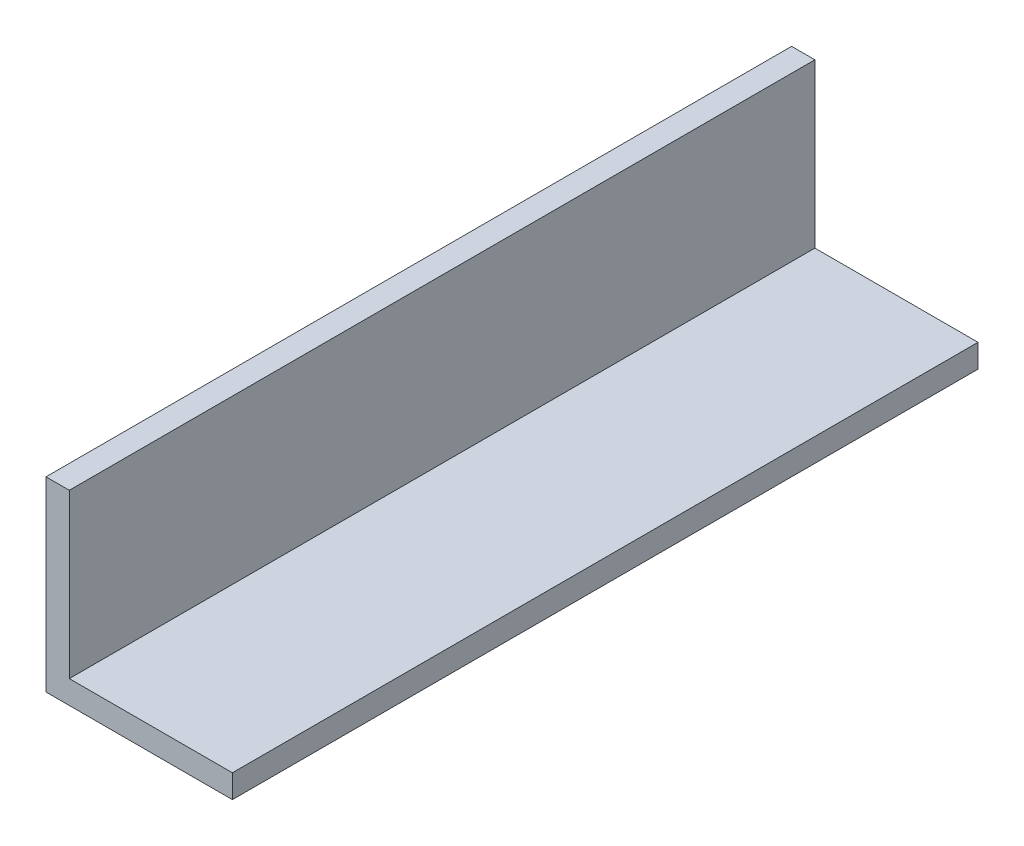
ISO-10303-21;
HEADER;
FILE_DESCRIPTION(('STEP AP214'),'2;1');
FILE_NAME('part.step','',(''),(''),'','','');
FILE_SCHEMA(('AUTOMOTIVE_DESIGN { 1 0 10303 214 1 1 1 1 }'));
ENDSEC;
DATA;
#1=APPLICATION_CONTEXT('core data for automotive mechanical design processes');
#2=APPLICATION_PROTOCOL_DEFINITION('international standard','automotive_design',2000,#1);
#3=PRODUCT_CONTEXT('',#1,'mechanical');
#4=PRODUCT('Part','Part','',(#3));
#5=PRODUCT_RELATED_PRODUCT_CATEGORY('part','',(#4));
#6=PRODUCT_DEFINITION_FORMATION('','',#4);
#7=PRODUCT_DEFINITION_CONTEXT('part definition',#1,'design');
#8=PRODUCT_DEFINITION('design','',#6,#7);
#9=PRODUCT_DEFINITION_SHAPE('','',#8);
#10=(LENGTH_UNIT() NAMED_UNIT(*) SI_UNIT(.MILLI.,.METRE.));
#11=(NAMED_UNIT(*) PLANE_ANGLE_UNIT() SI_UNIT($,.RADIAN.));
#12=(NAMED_UNIT(*) SI_UNIT($,.STERADIAN.) SOLID_ANGLE_UNIT());
#13=UNCERTAINTY_MEASURE_WITH_UNIT(LENGTH_MEASURE(1.E-05),#10,'distance_accuracy_value','');
#14=(GEOMETRIC_REPRESENTATION_CONTEXT(3) GLOBAL_UNCERTAINTY_ASSIGNED_CONTEXT((#13)) GLOBAL_UNIT_ASSIGNED_CONTEXT((#10,
#11,#12)) REPRESENTATION_CONTEXT('',''));
#15=CARTESIAN_POINT('',(0.,0.,0.));
#16=DIRECTION('',(0.,0.,1.));
#17=DIRECTION('',(1.,0.,0.));
#18=AXIS2_PLACEMENT_3D('',#15,#16,#17);
#19=CARTESIAN_POINT('',(3.175,25.4,50.8));
#20=DIRECTION('',(0.,-1.,0.));
#21=DIRECTION('',(0.,0.,-1.));
#22=AXIS2_PLACEMENT_3D('',#19,#20,#21);
#23=PLANE('',#22);
#24=DIRECTION('',(-1.,0.,0.));
#25=VECTOR('',#24,1.);
#26=CARTESIAN_POINT('',(3.175,25.4,-50.8));
#27=LINE('',#26,#25);
#28=CARTESIAN_POINT('',(3.175,25.4,-50.8));
#29=VERTEX_POINT('',#28);
#30=CARTESIAN_POINT('',(0.,25.4,-50.8));
#31=VERTEX_POINT('',#30);
#32=EDGE_CURVE('E127',#29,#31,#27,.T.);
#33=ORIENTED_EDGE('',*,*,#32,.T.);
#34=DIRECTION('',(0.,0.,-1.));
#35=VECTOR('',#34,1.);
#36=CARTESIAN_POINT('',(0.,25.4,50.8));
#37=LINE('',#36,#35);
#38=CARTESIAN_POINT('',(0.,25.4,50.8));
#39=VERTEX_POINT('',#38);
#40=EDGE_CURVE('E11',#39,#31,#37,.T.);
#41=ORIENTED_EDGE('',*,*,#40,.F.);
#42=DIRECTION('',(-1.,0.,0.));
#43=VECTOR('',#42,1.);
#44=CARTESIAN_POINT('',(3.175,25.4,50.8));
#45=LINE('',#44,#43);
#46=CARTESIAN_POINT('',(3.175,25.4,50.8));
#47=VERTEX_POINT('',#46);
#48=EDGE_CURVE('E137',#47,#39,#45,.T.);
#49=ORIENTED_EDGE('',*,*,#48,.F.);
#50=DIRECTION('',(0.,0.,-1.));
#51=VECTOR('',#50,1.);
#52=CARTESIAN_POINT('',(3.175,25.4,50.8));
#53=LINE('',#52,#51);
#54=EDGE_CURVE('E123',#47,#29,#53,.T.);
#55=ORIENTED_EDGE('',*,*,#54,.T.);
#56=EDGE_LOOP('',(#33,#41,#49,#55));
#57=FACE_BOUND('',#56,.T.);
#58=ADVANCED_FACE('F43',(#57),#23,.F.);
#59=CARTESIAN_POINT('',(0.,25.4,50.8));
#60=DIRECTION('',(1.,0.,0.));
#61=DIRECTION('',(0.,0.,-1.));
#62=AXIS2_PLACEMENT_3D('',#59,#60,#61);
#63=PLANE('',#62);
#64=DIRECTION('',(0.,-1.,0.));
#65=VECTOR('',#64,1.);
#66=CARTESIAN_POINT('',(0.,25.4,-50.8));
#67=LINE('',#66,#65);
#68=CARTESIAN_POINT('',(0.,0.,-50.8));
#69=VERTEX_POINT('',#68);
#70=EDGE_CURVE('E130',#31,#69,#67,.T.);
#71=ORIENTED_EDGE('',*,*,#70,.T.);
#72=DIRECTION('',(0.,0.,-1.));
#73=VECTOR('',#72,1.);
#74=CARTESIAN_POINT('',(0.,0.,50.8));
#75=LINE('',#74,#73);
#76=CARTESIAN_POINT('',(0.,0.,50.8));
#77=VERTEX_POINT('',#76);
#78=EDGE_CURVE('E51',#77,#69,#75,.T.);
#79=ORIENTED_EDGE('',*,*,#78,.F.);
#80=DIRECTION('',(0.,-1.,0.));
#81=VECTOR('',#80,1.);
#82=CARTESIAN_POINT('',(0.,25.4,50.8));
#83=LINE('',#82,#81);
#84=EDGE_CURVE('E96',#39,#77,#83,.T.);
#85=ORIENTED_EDGE('',*,*,#84,.F.);
#86=ORIENTED_EDGE('',*,*,#40,.T.);
#87=EDGE_LOOP('',(#71,#79,#85,#86));
#88=FACE_BOUND('',#87,.T.);
#89=ADVANCED_FACE('F161',(#88),#63,.F.);
#90=CARTESIAN_POINT('',(0.,0.,50.8));
#91=DIRECTION('',(0.,1.,0.));
#92=DIRECTION('',(0.,0.,1.));
#93=AXIS2_PLACEMENT_3D('',#90,#91,#92);
#94=PLANE('',#93);
#95=DIRECTION('',(1.,0.,0.));
#96=VECTOR('',#95,1.);
#97=CARTESIAN_POINT('',(0.,0.,-50.8));
#98=LINE('',#97,#96);
#99=CARTESIAN_POINT('',(25.4,0.,-50.8));
#100=VERTEX_POINT('',#99);
#101=EDGE_CURVE('E132',#69,#100,#98,.T.);
#102=ORIENTED_EDGE('',*,*,#101,.T.);
#103=DIRECTION('',(0.,0.,-1.));
#104=VECTOR('',#103,1.);
#105=CARTESIAN_POINT('',(25.4,0.,50.8));
#106=LINE('',#105,#104);
#107=CARTESIAN_POINT('',(25.4,0.,50.8));
#108=VERTEX_POINT('',#107);
#109=EDGE_CURVE('E118',#108,#100,#106,.T.);
#110=ORIENTED_EDGE('',*,*,#109,.F.);
#111=DIRECTION('',(1.,0.,0.));
#112=VECTOR('',#111,1.);
#113=CARTESIAN_POINT('',(0.,0.,50.8));
#114=LINE('',#113,#112);
#115=EDGE_CURVE('E109',#77,#108,#114,.T.);
#116=ORIENTED_EDGE('',*,*,#115,.F.);
#117=ORIENTED_EDGE('',*,*,#78,.T.);
#118=EDGE_LOOP('',(#102,#110,#116,#117));
#119=FACE_BOUND('',#118,.T.);
#120=ADVANCED_FACE('F143',(#119),#94,.F.);
#121=CARTESIAN_POINT('',(25.4,0.,50.8));
#122=DIRECTION('',(-1.,0.,0.));
#123=DIRECTION('',(0.,0.,1.));
#124=AXIS2_PLACEMENT_3D('',#121,#122,#123);
#125=PLANE('',#124);
#126=DIRECTION('',(0.,1.,0.));
#127=VECTOR('',#126,1.);
#128=CARTESIAN_POINT('',(25.4,0.,-50.8));
#129=LINE('',#128,#127);
#130=CARTESIAN_POINT('',(25.4,3.175,-50.8));
#131=VERTEX_POINT('',#130);
#132=EDGE_CURVE('E117',#100,#131,#129,.T.);
#133=ORIENTED_EDGE('',*,*,#132,.T.);
#134=DIRECTION('',(0.,0.,-1.));
#135=VECTOR('',#134,1.);
#136=CARTESIAN_POINT('',(25.4,3.175,50.8));
#137=LINE('',#136,#135);
#138=CARTESIAN_POINT('',(25.4,3.175,50.8));
#139=VERTEX_POINT('',#138);
#140=EDGE_CURVE('E114',#139,#131,#137,.T.);
#141=ORIENTED_EDGE('',*,*,#140,.F.);
#142=DIRECTION('',(0.,1.,0.));
#143=VECTOR('',#142,1.);
#144=CARTESIAN_POINT('',(25.4,0.,50.8));
#145=LINE('',#144,#143);
#146=EDGE_CURVE('E103',#108,#139,#145,.T.);
#147=ORIENTED_EDGE('',*,*,#146,.F.);
#148=ORIENTED_EDGE('',*,*,#109,.T.);
#149=EDGE_LOOP('',(#133,#141,#147,#148));
#150=FACE_BOUND('',#149,.T.);
#151=ADVANCED_FACE('F115',(#150),#125,.F.);
#152=CARTESIAN_POINT('',(25.4,3.175,50.8));
#153=DIRECTION('',(0.,-1.,0.));
#154=DIRECTION('',(0.,0.,-1.));
#155=AXIS2_PLACEMENT_3D('',#152,#153,#154);
#156=PLANE('',#155);
#157=DIRECTION('',(-1.,0.,0.));
#158=VECTOR('',#157,1.);
#159=CARTESIAN_POINT('',(25.4,3.175,-50.8));
#160=LINE('',#159,#158);
#161=CARTESIAN_POINT('',(3.175,3.175,-50.8));
#162=VERTEX_POINT('',#161);
#163=EDGE_CURVE('E82',#131,#162,#160,.T.);
#164=ORIENTED_EDGE('',*,*,#163,.T.);
#165=DIRECTION('',(0.,0.,-1.));
#166=VECTOR('',#165,1.);
#167=CARTESIAN_POINT('',(3.175,3.175,50.8));
#168=LINE('',#167,#166);
#169=CARTESIAN_POINT('',(3.175,3.175,50.8));
#170=VERTEX_POINT('',#169);
#171=EDGE_CURVE('E119',#170,#162,#168,.T.);
#172=ORIENTED_EDGE('',*,*,#171,.F.);
#173=DIRECTION('',(-1.,0.,0.));
#174=VECTOR('',#173,1.);
#175=CARTESIAN_POINT('',(25.4,3.175,50.8));
#176=LINE('',#175,#174);
#177=EDGE_CURVE('E107',#139,#170,#176,.T.);
#178=ORIENTED_EDGE('',*,*,#177,.F.);
#179=ORIENTED_EDGE('',*,*,#140,.T.);
#180=EDGE_LOOP('',(#164,#172,#178,#179));
#181=FACE_BOUND('',#180,.T.);
#182=ADVANCED_FACE('F121',(#181),#156,.F.);
#183=CARTESIAN_POINT('',(3.175,3.175,50.8));
#184=DIRECTION('',(-1.,0.,0.));
#185=DIRECTION('',(0.,0.,1.));
#186=AXIS2_PLACEMENT_3D('',#183,#184,#185);
#187=PLANE('',#186);
#188=DIRECTION('',(0.,1.,0.));
#189=VECTOR('',#188,1.);
#190=CARTESIAN_POINT('',(3.175,3.175,-50.8));
#191=LINE('',#190,#189);
#192=EDGE_CURVE('E88',#162,#29,#191,.T.);
#193=ORIENTED_EDGE('',*,*,#192,.T.);
#194=ORIENTED_EDGE('',*,*,#54,.F.);
#195=DIRECTION('',(0.,1.,0.));
#196=VECTOR('',#195,1.);
#197=CARTESIAN_POINT('',(3.175,3.175,50.8));
#198=LINE('',#197,#196);
#199=EDGE_CURVE('E59',#170,#47,#198,.T.);
#200=ORIENTED_EDGE('',*,*,#199,.F.);
#201=ORIENTED_EDGE('',*,*,#171,.T.);
#202=EDGE_LOOP('',(#193,#194,#200,#201));
#203=FACE_BOUND('',#202,.T.);
#204=ADVANCED_FACE('F150',(#203),#187,.F.);
#205=CARTESIAN_POINT('',(0.,0.,50.8));
#206=DIRECTION('',(0.,0.,1.));
#207=DIRECTION('',(1.,0.,0.));
#208=AXIS2_PLACEMENT_3D('',#205,#206,#207);
#209=PLANE('',#208);
#210=ORIENTED_EDGE('',*,*,#48,.T.);
#211=ORIENTED_EDGE('',*,*,#84,.T.);
#212=ORIENTED_EDGE('',*,*,#115,.T.);
#213=ORIENTED_EDGE('',*,*,#146,.T.);
#214=ORIENTED_EDGE('',*,*,#177,.T.);
#215=ORIENTED_EDGE('',*,*,#199,.T.);
#216=EDGE_LOOP('',(#210,#211,#212,#213,#214,#215));
#217=FACE_BOUND('',#216,.T.);
#218=ADVANCED_FACE('F105',(#217),#209,.T.);
#219=CARTESIAN_POINT('',(0.,0.,-50.8));
#220=DIRECTION('',(0.,0.,1.));
#221=DIRECTION('',(1.,0.,0.));
#222=AXIS2_PLACEMENT_3D('',#219,#220,#221);
#223=PLANE('',#222);
#224=ORIENTED_EDGE('',*,*,#32,.F.);
#225=ORIENTED_EDGE('',*,*,#192,.F.);
#226=ORIENTED_EDGE('',*,*,#163,.F.);
#227=ORIENTED_EDGE('',*,*,#132,.F.);
#228=ORIENTED_EDGE('',*,*,#101,.F.);
#229=ORIENTED_EDGE('',*,*,#70,.F.);
#230=EDGE_LOOP('',(#224,#225,#226,#227,#228,#229));
#231=FACE_BOUND('',#230,.T.);
#232=ADVANCED_FACE('F146',(#231),#223,.F.);
#233=CLOSED_SHELL('',(#58,#89,#120,#151,#182,#204,#218,#232));
#234=MANIFOLD_SOLID_BREP('B2',#233);
#235=ADVANCED_BREP_SHAPE_REPRESENTATION('',(#18,#234),#14);
#236=SHAPE_DEFINITION_REPRESENTATION(#9,#235);
ENDSEC;
END-ISO-10303-21;
